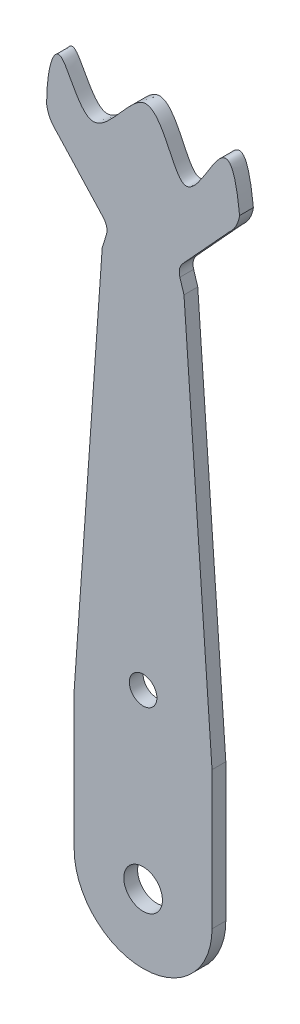
ISO-10303-21;
HEADER;
FILE_DESCRIPTION(('STEP AP214'),'2;1');
FILE_NAME('part.step','',(''),(''),'','','');
FILE_SCHEMA(('AUTOMOTIVE_DESIGN { 1 0 10303 214 1 1 1 1 }'));
ENDSEC;
DATA;
#1=APPLICATION_CONTEXT('core data for automotive mechanical design processes');
#2=APPLICATION_PROTOCOL_DEFINITION('international standard','automotive_design',2000,#1);
#3=PRODUCT_CONTEXT('',#1,'mechanical');
#4=PRODUCT('Part','Part','',(#3));
#5=PRODUCT_RELATED_PRODUCT_CATEGORY('part','',(#4));
#6=PRODUCT_DEFINITION_FORMATION('','',#4);
#7=PRODUCT_DEFINITION_CONTEXT('part definition',#1,'design');
#8=PRODUCT_DEFINITION('design','',#6,#7);
#9=PRODUCT_DEFINITION_SHAPE('','',#8);
#10=(LENGTH_UNIT() NAMED_UNIT(*) SI_UNIT(.MILLI.,.METRE.));
#11=(NAMED_UNIT(*) PLANE_ANGLE_UNIT() SI_UNIT($,.RADIAN.));
#12=(NAMED_UNIT(*) SI_UNIT($,.STERADIAN.) SOLID_ANGLE_UNIT());
#13=UNCERTAINTY_MEASURE_WITH_UNIT(LENGTH_MEASURE(1.E-05),#10,'distance_accuracy_value','');
#14=(GEOMETRIC_REPRESENTATION_CONTEXT(3) GLOBAL_UNCERTAINTY_ASSIGNED_CONTEXT((#13)) GLOBAL_UNIT_ASSIGNED_CONTEXT((#10,
#11,#12)) REPRESENTATION_CONTEXT('',''));
#15=CARTESIAN_POINT('',(0.,0.,0.));
#16=DIRECTION('',(0.,0.,1.));
#17=DIRECTION('',(1.,0.,0.));
#18=AXIS2_PLACEMENT_3D('',#15,#16,#17);
#19=CARTESIAN_POINT('',(52.2059904000001,30.0497409874,-1.));
#20=CARTESIAN_POINT('',(51.4108539988503,37.450521910936,-1.));
#21=CARTESIAN_POINT('',(48.5489343860614,24.4278431852089,-1.));
#22=CARTESIAN_POINT('',(45.9531290783355,36.745083031822,-1.));
#23=CARTESIAN_POINT('',(41.2979389966088,28.0048109721993,-1.));
#24=CARTESIAN_POINT('',(39.0798534507242,35.7220983288441,-1.));
#25=CARTESIAN_POINT('',(38.2030243408723,32.1044748765829,-1.));
#26=CARTESIAN_POINT('',(38.2059903999999,30.0497409874,-1.));
#27=B_SPLINE_CURVE_WITH_KNOTS('',3,(#19,#20,#21,#22,#23,#24,#25,#26),.UNSPECIFIED.,.F.,.F.,(4,1,
1,1,1,4),(0.,0.352722742785695,0.547893705300736,0.704624908377376,0.854467764578589,1.),.UNSPECIFIED.);
#28=DIRECTION('',(0.,0.,1.));
#29=VECTOR('',#28,1.);
#30=SURFACE_OF_LINEAR_EXTRUSION('',#27,#29);
#31=CARTESIAN_POINT('',(52.2059904000001,30.0497409874,0.));
#32=CARTESIAN_POINT('',(51.4108539988503,37.450521910936,0.));
#33=CARTESIAN_POINT('',(48.5489343860614,24.4278431852089,0.));
#34=CARTESIAN_POINT('',(45.9531290783355,36.745083031822,0.));
#35=CARTESIAN_POINT('',(41.2979389966088,28.0048109721993,0.));
#36=CARTESIAN_POINT('',(39.0798534507242,35.7220983288441,0.));
#37=CARTESIAN_POINT('',(38.2030243408723,32.1044748765829,0.));
#38=CARTESIAN_POINT('',(38.2059903999999,30.0497409874,0.));
#39=B_SPLINE_CURVE_WITH_KNOTS('',3,(#31,#32,#33,#34,#35,#36,#37,#38),.UNSPECIFIED.,.F.,.F.,(4,1,
1,1,1,4),(0.,0.352722742785695,0.547893705300736,0.704624908377376,0.854467764578589,1.),.UNSPECIFIED.);
#40=CARTESIAN_POINT('',(52.2059904000001,30.0497409874,0.));
#41=VERTEX_POINT('',#40);
#42=CARTESIAN_POINT('',(38.2059903999999,30.0497409874,0.));
#43=VERTEX_POINT('',#42);
#44=EDGE_CURVE('E171',#41,#43,#39,.T.);
#45=ORIENTED_EDGE('',*,*,#44,.F.);
#46=DIRECTION('',(0.,0.,1.));
#47=VECTOR('',#46,1.);
#48=CARTESIAN_POINT('',(52.2059904000001,30.0497409874,-1.));
#49=LINE('',#48,#47);
#50=CARTESIAN_POINT('',(52.2059904000001,30.0497409874,-1.));
#51=VERTEX_POINT('',#50);
#52=EDGE_CURVE('E11',#51,#41,#49,.T.);
#53=ORIENTED_EDGE('',*,*,#52,.F.);
#54=CARTESIAN_POINT('',(38.2059903999999,30.0497409874,-1.));
#55=VERTEX_POINT('',#54);
#56=EDGE_CURVE('E215',#51,#55,#27,.T.);
#57=ORIENTED_EDGE('',*,*,#56,.T.);
#58=DIRECTION('',(0.,0.,1.));
#59=VECTOR('',#58,1.);
#60=CARTESIAN_POINT('',(38.2059903999999,30.0497409874,-1.));
#61=LINE('',#60,#59);
#62=EDGE_CURVE('E41',#55,#43,#61,.T.);
#63=ORIENTED_EDGE('',*,*,#62,.T.);
#64=EDGE_LOOP('',(#45,#53,#57,#63));
#65=FACE_BOUND('',#64,.T.);
#66=ADVANCED_FACE('F37',(#65),#30,.T.);
#67=CARTESIAN_POINT('',(49.9373102086415,30.3581829823803,-1.));
#68=DIRECTION('',(0.,0.,1.));
#69=DIRECTION('',(1.,0.,0.));
#70=AXIS2_PLACEMENT_3D('',#67,#68,#69);
#71=CYLINDRICAL_SURFACE('',#70,2.28955154450167);
#72=CARTESIAN_POINT('',(49.9373102086415,30.3581829823803,0.));
#73=DIRECTION('',(0.,0.,1.));
#74=DIRECTION('',(1.,0.,0.));
#75=AXIS2_PLACEMENT_3D('',#72,#73,#74);
#76=CIRCLE('',#75,2.28955154450167);
#77=CARTESIAN_POINT('',(51.4402872046372,28.6310158148954,0.));
#78=VERTEX_POINT('',#77);
#79=EDGE_CURVE('E213',#78,#41,#76,.T.);
#80=ORIENTED_EDGE('',*,*,#79,.F.);
#81=DIRECTION('',(0.,0.,1.));
#82=VECTOR('',#81,1.);
#83=CARTESIAN_POINT('',(51.4402872046372,28.6310158148954,-1.));
#84=LINE('',#83,#82);
#85=CARTESIAN_POINT('',(51.4402872046372,28.6310158148954,-1.));
#86=VERTEX_POINT('',#85);
#87=EDGE_CURVE('E47',#86,#78,#84,.T.);
#88=ORIENTED_EDGE('',*,*,#87,.F.);
#89=CARTESIAN_POINT('',(49.9373102086415,30.3581829823803,-1.));
#90=DIRECTION('',(0.,0.,1.));
#91=DIRECTION('',(1.,0.,0.));
#92=AXIS2_PLACEMENT_3D('',#89,#90,#91);
#93=CIRCLE('',#92,2.28955154450167);
#94=EDGE_CURVE('E161',#86,#51,#93,.T.);
#95=ORIENTED_EDGE('',*,*,#94,.T.);
#96=ORIENTED_EDGE('',*,*,#52,.T.);
#97=EDGE_LOOP('',(#80,#88,#95,#96));
#98=FACE_BOUND('',#97,.T.);
#99=ADVANCED_FACE('F239',(#98),#71,.T.);
#100=CARTESIAN_POINT('',(48.0755558517,24.9600814275,-1.));
#101=DIRECTION('',(0.737183331595155,-0.675692781978813,0.));
#102=DIRECTION('',(0.675692781978813,0.737183331595155,0.));
#103=AXIS2_PLACEMENT_3D('',#100,#101,#102);
#104=PLANE('',#103);
#105=DIRECTION('',(0.675692781978813,0.737183331595155,0.));
#106=VECTOR('',#105,1.);
#107=CARTESIAN_POINT('',(48.0755558517,24.9600814275,0.));
#108=LINE('',#107,#106);
#109=CARTESIAN_POINT('',(48.0755558517,24.9600814275,0.));
#110=VERTEX_POINT('',#109);
#111=EDGE_CURVE('E148',#110,#78,#108,.T.);
#112=ORIENTED_EDGE('',*,*,#111,.F.);
#113=DIRECTION('',(0.,0.,1.));
#114=VECTOR('',#113,1.);
#115=CARTESIAN_POINT('',(48.0755558517,24.9600814275,-1.));
#116=LINE('',#115,#114);
#117=CARTESIAN_POINT('',(48.0755558517,24.9600814275,-1.));
#118=VERTEX_POINT('',#117);
#119=EDGE_CURVE('E143',#118,#110,#116,.T.);
#120=ORIENTED_EDGE('',*,*,#119,.F.);
#121=DIRECTION('',(0.675692781978813,0.737183331595155,0.));
#122=VECTOR('',#121,1.);
#123=CARTESIAN_POINT('',(48.0755558517,24.9600814275,-1.));
#124=LINE('',#123,#122);
#125=EDGE_CURVE('E146',#118,#86,#124,.T.);
#126=ORIENTED_EDGE('',*,*,#125,.T.);
#127=ORIENTED_EDGE('',*,*,#87,.T.);
#128=EDGE_LOOP('',(#112,#120,#126,#127));
#129=FACE_BOUND('',#128,.T.);
#130=ADVANCED_FACE('F145',(#129),#104,.T.);
#131=CARTESIAN_POINT('',(48.827648606876,24.3010241556225,-1.));
#132=DIRECTION('',(0.,0.,1.));
#133=DIRECTION('',(1.,0.,0.));
#134=AXIS2_PLACEMENT_3D('',#131,#132,#133);
#135=CYLINDRICAL_SURFACE('',#134,1.00000000000141);
#136=CARTESIAN_POINT('',(48.827648606876,24.3010241556225,0.));
#137=DIRECTION('',(0.,0.,-1.));
#138=DIRECTION('',(1.,0.,0.));
#139=AXIS2_PLACEMENT_3D('',#136,#137,#138);
#140=CIRCLE('',#139,1.00000000000141);
#141=CARTESIAN_POINT('',(47.873069238,24.0030673995,0.));
#142=VERTEX_POINT('',#141);
#143=EDGE_CURVE('E210',#142,#110,#140,.T.);
#144=ORIENTED_EDGE('',*,*,#143,.F.);
#145=DIRECTION('',(0.,0.,1.));
#146=VECTOR('',#145,1.);
#147=CARTESIAN_POINT('',(47.873069238,24.0030673995,-1.));
#148=LINE('',#147,#146);
#149=CARTESIAN_POINT('',(47.873069238,24.0030673995,-1.));
#150=VERTEX_POINT('',#149);
#151=EDGE_CURVE('E153',#150,#142,#148,.T.);
#152=ORIENTED_EDGE('',*,*,#151,.F.);
#153=CARTESIAN_POINT('',(48.827648606876,24.3010241556225,-1.));
#154=DIRECTION('',(0.,0.,-1.));
#155=DIRECTION('',(1.,0.,0.));
#156=AXIS2_PLACEMENT_3D('',#153,#154,#155);
#157=CIRCLE('',#156,1.00000000000141);
#158=EDGE_CURVE('E159',#150,#118,#157,.T.);
#159=ORIENTED_EDGE('',*,*,#158,.T.);
#160=ORIENTED_EDGE('',*,*,#119,.T.);
#161=EDGE_LOOP('',(#144,#152,#159,#160));
#162=FACE_BOUND('',#161,.T.);
#163=ADVANCED_FACE('F163',(#162),#135,.F.);
#164=CARTESIAN_POINT('',(48.1711246513,23.0481719577,-1.));
#165=DIRECTION('',(0.954579368861853,0.297956756163216,0.));
#166=DIRECTION('',(-0.297956756163216,0.954579368861853,0.));
#167=AXIS2_PLACEMENT_3D('',#164,#165,#166);
#168=PLANE('',#167);
#169=DIRECTION('',(-0.297956756163216,0.954579368861853,0.));
#170=VECTOR('',#169,1.);
#171=CARTESIAN_POINT('',(48.1711246513,23.0481719577,0.));
#172=LINE('',#171,#170);
#173=CARTESIAN_POINT('',(48.1711246513,23.0481719577,0.));
#174=VERTEX_POINT('',#173);
#175=EDGE_CURVE('E207',#174,#142,#172,.T.);
#176=ORIENTED_EDGE('',*,*,#175,.F.);
#177=DIRECTION('',(0.,0.,1.));
#178=VECTOR('',#177,1.);
#179=CARTESIAN_POINT('',(48.1711246513,23.0481719577,-1.));
#180=LINE('',#179,#178);
#181=CARTESIAN_POINT('',(48.1711246513,23.0481719577,-1.));
#182=VERTEX_POINT('',#181);
#183=EDGE_CURVE('E219',#182,#174,#180,.T.);
#184=ORIENTED_EDGE('',*,*,#183,.F.);
#185=DIRECTION('',(-0.297956756163216,0.954579368861853,0.));
#186=VECTOR('',#185,1.);
#187=CARTESIAN_POINT('',(48.1711246513,23.0481719577,-1.));
#188=LINE('',#187,#186);
#189=EDGE_CURVE('E164',#182,#150,#188,.T.);
#190=ORIENTED_EDGE('',*,*,#189,.T.);
#191=ORIENTED_EDGE('',*,*,#151,.T.);
#192=EDGE_LOOP('',(#176,#184,#190,#191));
#193=FACE_BOUND('',#192,.T.);
#194=ADVANCED_FACE('F252',(#193),#168,.T.);
#195=CARTESIAN_POINT('',(50.2059904,-5.7615616,-1.));
#196=DIRECTION('',(0.997514911823608,0.0704556647086677,0.));
#197=DIRECTION('',(-0.0704556647086676,0.997514911823608,0.));
#198=AXIS2_PLACEMENT_3D('',#195,#196,#197);
#199=PLANE('',#198);
#200=DIRECTION('',(-0.0704556647086676,0.997514911823608,0.));
#201=VECTOR('',#200,1.);
#202=CARTESIAN_POINT('',(50.2059904,-5.7615616,0.));
#203=LINE('',#202,#201);
#204=CARTESIAN_POINT('',(50.2059904,-5.7615616,0.));
#205=VERTEX_POINT('',#204);
#206=EDGE_CURVE('E204',#205,#174,#203,.T.);
#207=ORIENTED_EDGE('',*,*,#206,.F.);
#208=DIRECTION('',(0.,0.,1.));
#209=VECTOR('',#208,1.);
#210=CARTESIAN_POINT('',(50.2059904,-5.7615616,-1.));
#211=LINE('',#210,#209);
#212=CARTESIAN_POINT('',(50.2059904,-5.7615616,-1.));
#213=VERTEX_POINT('',#212);
#214=EDGE_CURVE('E221',#213,#205,#211,.T.);
#215=ORIENTED_EDGE('',*,*,#214,.F.);
#216=DIRECTION('',(-0.0704556647086676,0.997514911823608,0.));
#217=VECTOR('',#216,1.);
#218=CARTESIAN_POINT('',(50.2059904,-5.7615616,-1.));
#219=LINE('',#218,#217);
#220=EDGE_CURVE('E166',#213,#182,#219,.T.);
#221=ORIENTED_EDGE('',*,*,#220,.T.);
#222=ORIENTED_EDGE('',*,*,#183,.T.);
#223=EDGE_LOOP('',(#207,#215,#221,#222));
#224=FACE_BOUND('',#223,.T.);
#225=ADVANCED_FACE('F255',(#224),#199,.T.);
#226=CARTESIAN_POINT('',(50.2059904,-15.7615616,-1.));
#227=DIRECTION('',(1.,0.,0.));
#228=DIRECTION('',(0.,0.,-1.));
#229=AXIS2_PLACEMENT_3D('',#226,#227,#228);
#230=PLANE('',#229);
#231=DIRECTION('',(0.,1.,0.));
#232=VECTOR('',#231,1.);
#233=CARTESIAN_POINT('',(50.2059904,-15.7615616,0.));
#234=LINE('',#233,#232);
#235=CARTESIAN_POINT('',(50.2059904,-15.7615616,0.));
#236=VERTEX_POINT('',#235);
#237=EDGE_CURVE('E201',#236,#205,#234,.T.);
#238=ORIENTED_EDGE('',*,*,#237,.F.);
#239=DIRECTION('',(0.,0.,1.));
#240=VECTOR('',#239,1.);
#241=CARTESIAN_POINT('',(50.2059904,-15.7615616,-1.));
#242=LINE('',#241,#240);
#243=CARTESIAN_POINT('',(50.2059904,-15.7615616,-1.));
#244=VERTEX_POINT('',#243);
#245=EDGE_CURVE('E223',#244,#236,#242,.T.);
#246=ORIENTED_EDGE('',*,*,#245,.F.);
#247=DIRECTION('',(0.,1.,0.));
#248=VECTOR('',#247,1.);
#249=CARTESIAN_POINT('',(50.2059904,-15.7615616,-1.));
#250=LINE('',#249,#248);
#251=EDGE_CURVE('E348',#244,#213,#250,.T.);
#252=ORIENTED_EDGE('',*,*,#251,.T.);
#253=ORIENTED_EDGE('',*,*,#214,.T.);
#254=EDGE_LOOP('',(#238,#246,#252,#253));
#255=FACE_BOUND('',#254,.T.);
#256=ADVANCED_FACE('F259',(#255),#230,.T.);
#257=CARTESIAN_POINT('',(45.2059904,-15.7615616,-1.));
#258=DIRECTION('',(0.,0.,1.));
#259=DIRECTION('',(1.,0.,0.));
#260=AXIS2_PLACEMENT_3D('',#257,#258,#259);
#261=CYLINDRICAL_SURFACE('',#260,5.);
#262=CARTESIAN_POINT('',(45.2059904,-15.7615616,0.));
#263=DIRECTION('',(0.,0.,1.));
#264=DIRECTION('',(1.,0.,0.));
#265=AXIS2_PLACEMENT_3D('',#262,#263,#264);
#266=CIRCLE('',#265,5.);
#267=CARTESIAN_POINT('',(40.2059904,-15.7615616,0.));
#268=VERTEX_POINT('',#267);
#269=EDGE_CURVE('E198',#268,#236,#266,.T.);
#270=ORIENTED_EDGE('',*,*,#269,.F.);
#271=DIRECTION('',(0.,0.,1.));
#272=VECTOR('',#271,1.);
#273=CARTESIAN_POINT('',(40.2059904,-15.7615616,-1.));
#274=LINE('',#273,#272);
#275=CARTESIAN_POINT('',(40.2059904,-15.7615616,-1.));
#276=VERTEX_POINT('',#275);
#277=EDGE_CURVE('E225',#276,#268,#274,.T.);
#278=ORIENTED_EDGE('',*,*,#277,.F.);
#279=CARTESIAN_POINT('',(45.2059904,-15.7615616,-1.));
#280=DIRECTION('',(0.,0.,1.));
#281=DIRECTION('',(1.,0.,0.));
#282=AXIS2_PLACEMENT_3D('',#279,#280,#281);
#283=CIRCLE('',#282,5.);
#284=EDGE_CURVE('E345',#276,#244,#283,.T.);
#285=ORIENTED_EDGE('',*,*,#284,.T.);
#286=ORIENTED_EDGE('',*,*,#245,.T.);
#287=EDGE_LOOP('',(#270,#278,#285,#286));
#288=FACE_BOUND('',#287,.T.);
#289=ADVANCED_FACE('F263',(#288),#261,.T.);
#290=CARTESIAN_POINT('',(40.2059904,-5.7615616,-1.));
#291=DIRECTION('',(-1.,0.,0.));
#292=DIRECTION('',(0.,0.,1.));
#293=AXIS2_PLACEMENT_3D('',#290,#291,#292);
#294=PLANE('',#293);
#295=DIRECTION('',(0.,-1.,0.));
#296=VECTOR('',#295,1.);
#297=CARTESIAN_POINT('',(40.2059904,-5.7615616,0.));
#298=LINE('',#297,#296);
#299=CARTESIAN_POINT('',(40.2059904,-5.7615616,0.));
#300=VERTEX_POINT('',#299);
#301=EDGE_CURVE('E195',#300,#268,#298,.T.);
#302=ORIENTED_EDGE('',*,*,#301,.F.);
#303=DIRECTION('',(0.,0.,1.));
#304=VECTOR('',#303,1.);
#305=CARTESIAN_POINT('',(40.2059904,-5.7615616,-1.));
#306=LINE('',#305,#304);
#307=CARTESIAN_POINT('',(40.2059904,-5.7615616,-1.));
#308=VERTEX_POINT('',#307);
#309=EDGE_CURVE('E227',#308,#300,#306,.T.);
#310=ORIENTED_EDGE('',*,*,#309,.F.);
#311=DIRECTION('',(0.,-1.,0.));
#312=VECTOR('',#311,1.);
#313=CARTESIAN_POINT('',(40.2059904,-5.7615616,-1.));
#314=LINE('',#313,#312);
#315=EDGE_CURVE('E342',#308,#276,#314,.T.);
#316=ORIENTED_EDGE('',*,*,#315,.T.);
#317=ORIENTED_EDGE('',*,*,#277,.T.);
#318=EDGE_LOOP('',(#302,#310,#316,#317));
#319=FACE_BOUND('',#318,.T.);
#320=ADVANCED_FACE('F267',(#319),#294,.T.);
#321=CARTESIAN_POINT('',(42.2408561487,23.0481719577,-1.));
#322=DIRECTION('',(-0.997514911823608,0.0704556647086677,0.));
#323=DIRECTION('',(-0.0704556647086676,-0.997514911823608,0.));
#324=AXIS2_PLACEMENT_3D('',#321,#322,#323);
#325=PLANE('',#324);
#326=DIRECTION('',(-0.0704556647086676,-0.997514911823608,0.));
#327=VECTOR('',#326,1.);
#328=CARTESIAN_POINT('',(42.2408561487,23.0481719577,0.));
#329=LINE('',#328,#327);
#330=CARTESIAN_POINT('',(42.2408561487,23.0481719577,0.));
#331=VERTEX_POINT('',#330);
#332=EDGE_CURVE('E192',#331,#300,#329,.T.);
#333=ORIENTED_EDGE('',*,*,#332,.F.);
#334=DIRECTION('',(0.,0.,1.));
#335=VECTOR('',#334,1.);
#336=CARTESIAN_POINT('',(42.2408561487,23.0481719577,-1.));
#337=LINE('',#336,#335);
#338=CARTESIAN_POINT('',(42.2408561487,23.0481719577,-1.));
#339=VERTEX_POINT('',#338);
#340=EDGE_CURVE('E229',#339,#331,#337,.T.);
#341=ORIENTED_EDGE('',*,*,#340,.F.);
#342=DIRECTION('',(-0.0704556647086676,-0.997514911823608,0.));
#343=VECTOR('',#342,1.);
#344=CARTESIAN_POINT('',(42.2408561487,23.0481719577,-1.));
#345=LINE('',#344,#343);
#346=EDGE_CURVE('E339',#339,#308,#345,.T.);
#347=ORIENTED_EDGE('',*,*,#346,.T.);
#348=ORIENTED_EDGE('',*,*,#309,.T.);
#349=EDGE_LOOP('',(#333,#341,#347,#348));
#350=FACE_BOUND('',#349,.T.);
#351=ADVANCED_FACE('F271',(#350),#325,.T.);
#352=CARTESIAN_POINT('',(42.538911562,24.0030673995,-1.));
#353=DIRECTION('',(-0.954579368861851,0.297956756163222,0.));
#354=DIRECTION('',(-0.297956756163222,-0.954579368861851,0.));
#355=AXIS2_PLACEMENT_3D('',#352,#353,#354);
#356=PLANE('',#355);
#357=DIRECTION('',(-0.297956756163222,-0.954579368861851,0.));
#358=VECTOR('',#357,1.);
#359=CARTESIAN_POINT('',(42.538911562,24.0030673995,0.));
#360=LINE('',#359,#358);
#361=CARTESIAN_POINT('',(42.538911562,24.0030673995,0.));
#362=VERTEX_POINT('',#361);
#363=EDGE_CURVE('E189',#362,#331,#360,.T.);
#364=ORIENTED_EDGE('',*,*,#363,.F.);
#365=DIRECTION('',(0.,0.,1.));
#366=VECTOR('',#365,1.);
#367=CARTESIAN_POINT('',(42.538911562,24.0030673995,-1.));
#368=LINE('',#367,#366);
#369=CARTESIAN_POINT('',(42.538911562,24.0030673995,-1.));
#370=VERTEX_POINT('',#369);
#371=EDGE_CURVE('E231',#370,#362,#368,.T.);
#372=ORIENTED_EDGE('',*,*,#371,.F.);
#373=DIRECTION('',(-0.297956756163222,-0.954579368861851,0.));
#374=VECTOR('',#373,1.);
#375=CARTESIAN_POINT('',(42.538911562,24.0030673995,-1.));
#376=LINE('',#375,#374);
#377=EDGE_CURVE('E336',#370,#339,#376,.T.);
#378=ORIENTED_EDGE('',*,*,#377,.T.);
#379=ORIENTED_EDGE('',*,*,#340,.T.);
#380=EDGE_LOOP('',(#364,#372,#378,#379));
#381=FACE_BOUND('',#380,.T.);
#382=ADVANCED_FACE('F275',(#381),#356,.T.);
#383=CARTESIAN_POINT('',(41.5843321931261,24.301024155623,-1.));
#384=DIRECTION('',(0.,0.,1.));
#385=DIRECTION('',(1.,0.,0.));
#386=AXIS2_PLACEMENT_3D('',#383,#384,#385);
#387=CYLINDRICAL_SURFACE('',#386,0.999999999999549);
#388=CARTESIAN_POINT('',(41.5843321931261,24.301024155623,0.));
#389=DIRECTION('',(0.,0.,-1.));
#390=DIRECTION('',(1.,0.,0.));
#391=AXIS2_PLACEMENT_3D('',#388,#389,#390);
#392=CIRCLE('',#391,0.999999999999549);
#393=CARTESIAN_POINT('',(42.3364249483,24.9600814275,0.));
#394=VERTEX_POINT('',#393);
#395=EDGE_CURVE('E186',#394,#362,#392,.T.);
#396=ORIENTED_EDGE('',*,*,#395,.F.);
#397=DIRECTION('',(0.,0.,1.));
#398=VECTOR('',#397,1.);
#399=CARTESIAN_POINT('',(42.3364249483,24.9600814275,-1.));
#400=LINE('',#399,#398);
#401=CARTESIAN_POINT('',(42.3364249483,24.9600814275,-1.));
#402=VERTEX_POINT('',#401);
#403=EDGE_CURVE('E233',#402,#394,#400,.T.);
#404=ORIENTED_EDGE('',*,*,#403,.F.);
#405=CARTESIAN_POINT('',(41.5843321931261,24.301024155623,-1.));
#406=DIRECTION('',(0.,0.,-1.));
#407=DIRECTION('',(1.,0.,0.));
#408=AXIS2_PLACEMENT_3D('',#405,#406,#407);
#409=CIRCLE('',#408,0.999999999999549);
#410=EDGE_CURVE('E333',#402,#370,#409,.T.);
#411=ORIENTED_EDGE('',*,*,#410,.T.);
#412=ORIENTED_EDGE('',*,*,#371,.T.);
#413=EDGE_LOOP('',(#396,#404,#411,#412));
#414=FACE_BOUND('',#413,.T.);
#415=ADVANCED_FACE('F279',(#414),#387,.F.);
#416=CARTESIAN_POINT('',(42.3364249483,24.9600814275,-1.));
#417=DIRECTION('',(-0.737183331595152,-0.675692781978817,0.));
#418=DIRECTION('',(0.675692781978817,-0.737183331595152,0.));
#419=AXIS2_PLACEMENT_3D('',#416,#417,#418);
#420=PLANE('',#419);
#421=DIRECTION('',(0.675692781978817,-0.737183331595152,0.));
#422=VECTOR('',#421,1.);
#423=CARTESIAN_POINT('',(42.3364249483,24.9600814275,0.));
#424=LINE('',#423,#422);
#425=CARTESIAN_POINT('',(38.9716935953628,28.6310158148954,0.));
#426=VERTEX_POINT('',#425);
#427=EDGE_CURVE('E183',#426,#394,#424,.T.);
#428=ORIENTED_EDGE('',*,*,#427,.F.);
#429=DIRECTION('',(0.,0.,1.));
#430=VECTOR('',#429,1.);
#431=CARTESIAN_POINT('',(38.9716935953628,28.6310158148954,-1.));
#432=LINE('',#431,#430);
#433=CARTESIAN_POINT('',(38.9716935953628,28.6310158148954,-1.));
#434=VERTEX_POINT('',#433);
#435=EDGE_CURVE('E234',#434,#426,#432,.T.);
#436=ORIENTED_EDGE('',*,*,#435,.F.);
#437=DIRECTION('',(0.675692781978817,-0.737183331595152,0.));
#438=VECTOR('',#437,1.);
#439=CARTESIAN_POINT('',(42.3364249483,24.9600814275,-1.));
#440=LINE('',#439,#438);
#441=EDGE_CURVE('E330',#434,#402,#440,.T.);
#442=ORIENTED_EDGE('',*,*,#441,.T.);
#443=ORIENTED_EDGE('',*,*,#403,.T.);
#444=EDGE_LOOP('',(#428,#436,#442,#443));
#445=FACE_BOUND('',#444,.T.);
#446=ADVANCED_FACE('F283',(#445),#420,.T.);
#447=CARTESIAN_POINT('',(40.4746705913585,30.3581829823803,-1.));
#448=DIRECTION('',(0.,0.,1.));
#449=DIRECTION('',(1.,0.,0.));
#450=AXIS2_PLACEMENT_3D('',#447,#448,#449);
#451=CYLINDRICAL_SURFACE('',#450,2.28955154450168);
#452=CARTESIAN_POINT('',(40.4746705913585,30.3581829823803,0.));
#453=DIRECTION('',(0.,0.,1.));
#454=DIRECTION('',(1.,0.,0.));
#455=AXIS2_PLACEMENT_3D('',#452,#453,#454);
#456=CIRCLE('',#455,2.28955154450168);
#457=EDGE_CURVE('E176',#43,#426,#456,.T.);
#458=ORIENTED_EDGE('',*,*,#457,.F.);
#459=ORIENTED_EDGE('',*,*,#62,.F.);
#460=CARTESIAN_POINT('',(40.4746705913585,30.3581829823803,-1.));
#461=DIRECTION('',(0.,0.,1.));
#462=DIRECTION('',(1.,0.,0.));
#463=AXIS2_PLACEMENT_3D('',#460,#461,#462);
#464=CIRCLE('',#463,2.28955154450168);
#465=EDGE_CURVE('E325',#55,#434,#464,.T.);
#466=ORIENTED_EDGE('',*,*,#465,.T.);
#467=ORIENTED_EDGE('',*,*,#435,.T.);
#468=EDGE_LOOP('',(#458,#459,#466,#467));
#469=FACE_BOUND('',#468,.T.);
#470=ADVANCED_FACE('F236',(#469),#451,.T.);
#471=CARTESIAN_POINT('',(46.0822217813307,33.3244811806455,-1.));
#472=DIRECTION('',(0.,0.,-1.));
#473=DIRECTION('',(-1.,0.,0.));
#474=AXIS2_PLACEMENT_3D('',#471,#472,#473);
#475=PLANE('',#474);
#476=CARTESIAN_POINT('',(45.2059904,-15.7615616,-1.));
#477=DIRECTION('',(0.,0.,1.));
#478=DIRECTION('',(1.,0.,0.));
#479=AXIS2_PLACEMENT_3D('',#476,#477,#478);
#480=CIRCLE('',#479,1.39999999995838);
#481=CARTESIAN_POINT('',(46.6059903999584,-15.7615616,-1.));
#482=VERTEX_POINT('',#481);
#483=EDGE_CURVE('E310',#482,#482,#480,.T.);
#484=ORIENTED_EDGE('',*,*,#483,.T.);
#485=EDGE_LOOP('',(#484));
#486=FACE_BOUND('',#485,.T.);
#487=CARTESIAN_POINT('',(45.2059904,-3.2615616,-1.));
#488=DIRECTION('',(0.,0.,1.));
#489=DIRECTION('',(1.,0.,0.));
#490=AXIS2_PLACEMENT_3D('',#487,#488,#489);
#491=CIRCLE('',#490,0.999999999958395);
#492=CARTESIAN_POINT('',(46.2059903999584,-3.2615616,-1.));
#493=VERTEX_POINT('',#492);
#494=EDGE_CURVE('E177',#493,#493,#491,.T.);
#495=ORIENTED_EDGE('',*,*,#494,.T.);
#496=EDGE_LOOP('',(#495));
#497=FACE_BOUND('',#496,.T.);
#498=ORIENTED_EDGE('',*,*,#56,.F.);
#499=ORIENTED_EDGE('',*,*,#94,.F.);
#500=ORIENTED_EDGE('',*,*,#125,.F.);
#501=ORIENTED_EDGE('',*,*,#158,.F.);
#502=ORIENTED_EDGE('',*,*,#189,.F.);
#503=ORIENTED_EDGE('',*,*,#220,.F.);
#504=ORIENTED_EDGE('',*,*,#251,.F.);
#505=ORIENTED_EDGE('',*,*,#284,.F.);
#506=ORIENTED_EDGE('',*,*,#315,.F.);
#507=ORIENTED_EDGE('',*,*,#346,.F.);
#508=ORIENTED_EDGE('',*,*,#377,.F.);
#509=ORIENTED_EDGE('',*,*,#410,.F.);
#510=ORIENTED_EDGE('',*,*,#441,.F.);
#511=ORIENTED_EDGE('',*,*,#465,.F.);
#512=EDGE_LOOP('',(#498,#499,#500,#501,#502,#503,#504,#505,#506,#507,#508,#509,#510,#511));
#513=FACE_BOUND('',#512,.T.);
#514=ADVANCED_FACE('F157',(#486,#497,#513),#475,.T.);
#515=CARTESIAN_POINT('',(46.0822217813307,33.3244811806455,0.));
#516=DIRECTION('',(0.,0.,-1.));
#517=DIRECTION('',(-1.,0.,0.));
#518=AXIS2_PLACEMENT_3D('',#515,#516,#517);
#519=PLANE('',#518);
#520=CARTESIAN_POINT('',(45.2059904,-15.7615616,0.));
#521=DIRECTION('',(0.,0.,1.));
#522=DIRECTION('',(1.,0.,0.));
#523=AXIS2_PLACEMENT_3D('',#520,#521,#522);
#524=CIRCLE('',#523,1.39999999995838);
#525=CARTESIAN_POINT('',(46.6059903999584,-15.7615616,0.));
#526=VERTEX_POINT('',#525);
#527=EDGE_CURVE('E313',#526,#526,#524,.T.);
#528=ORIENTED_EDGE('',*,*,#527,.F.);
#529=EDGE_LOOP('',(#528));
#530=FACE_BOUND('',#529,.T.);
#531=CARTESIAN_POINT('',(45.2059904,-3.2615616,0.));
#532=DIRECTION('',(0.,0.,1.));
#533=DIRECTION('',(1.,0.,0.));
#534=AXIS2_PLACEMENT_3D('',#531,#532,#533);
#535=CIRCLE('',#534,0.999999999958395);
#536=CARTESIAN_POINT('',(46.2059903999584,-3.2615616,0.));
#537=VERTEX_POINT('',#536);
#538=EDGE_CURVE('E315',#537,#537,#535,.T.);
#539=ORIENTED_EDGE('',*,*,#538,.F.);
#540=EDGE_LOOP('',(#539));
#541=FACE_BOUND('',#540,.T.);
#542=ORIENTED_EDGE('',*,*,#44,.T.);
#543=ORIENTED_EDGE('',*,*,#457,.T.);
#544=ORIENTED_EDGE('',*,*,#427,.T.);
#545=ORIENTED_EDGE('',*,*,#395,.T.);
#546=ORIENTED_EDGE('',*,*,#363,.T.);
#547=ORIENTED_EDGE('',*,*,#332,.T.);
#548=ORIENTED_EDGE('',*,*,#301,.T.);
#549=ORIENTED_EDGE('',*,*,#269,.T.);
#550=ORIENTED_EDGE('',*,*,#237,.T.);
#551=ORIENTED_EDGE('',*,*,#206,.T.);
#552=ORIENTED_EDGE('',*,*,#175,.T.);
#553=ORIENTED_EDGE('',*,*,#143,.T.);
#554=ORIENTED_EDGE('',*,*,#111,.T.);
#555=ORIENTED_EDGE('',*,*,#79,.T.);
#556=EDGE_LOOP('',(#542,#543,#544,#545,#546,#547,#548,#549,#550,#551,#552,#553,#554,#555));
#557=FACE_BOUND('',#556,.T.);
#558=ADVANCED_FACE('F238',(#530,#541,#557),#519,.F.);
#559=CARTESIAN_POINT('',(45.2059904,-3.2615616,-1.));
#560=DIRECTION('',(0.,0.,1.));
#561=DIRECTION('',(1.,0.,0.));
#562=AXIS2_PLACEMENT_3D('',#559,#560,#561);
#563=CYLINDRICAL_SURFACE('',#562,0.999999999958395);
#564=ORIENTED_EDGE('',*,*,#494,.F.);
#565=EDGE_LOOP('',(#564));
#566=FACE_BOUND('',#565,.T.);
#567=ORIENTED_EDGE('',*,*,#538,.T.);
#568=EDGE_LOOP('',(#567));
#569=FACE_BOUND('',#568,.T.);
#570=ADVANCED_FACE('F295',(#566,#569),#563,.F.);
#571=CARTESIAN_POINT('',(45.2059904,-15.7615616,-1.));
#572=DIRECTION('',(0.,0.,1.));
#573=DIRECTION('',(1.,0.,0.));
#574=AXIS2_PLACEMENT_3D('',#571,#572,#573);
#575=CYLINDRICAL_SURFACE('',#574,1.39999999995838);
#576=ORIENTED_EDGE('',*,*,#483,.F.);
#577=EDGE_LOOP('',(#576));
#578=FACE_BOUND('',#577,.T.);
#579=ORIENTED_EDGE('',*,*,#527,.T.);
#580=EDGE_LOOP('',(#579));
#581=FACE_BOUND('',#580,.T.);
#582=ADVANCED_FACE('F302',(#578,#581),#575,.F.);
#583=CLOSED_SHELL('',(#66,#99,#130,#163,#194,#225,#256,#289,#320,#351,#382,#415,#446,#470,#514,
#558,#570,#582));
#584=MANIFOLD_SOLID_BREP('B2',#583);
#585=ADVANCED_BREP_SHAPE_REPRESENTATION('',(#18,#584),#14);
#586=SHAPE_DEFINITION_REPRESENTATION(#9,#585);
ENDSEC;
END-ISO-10303-21;
